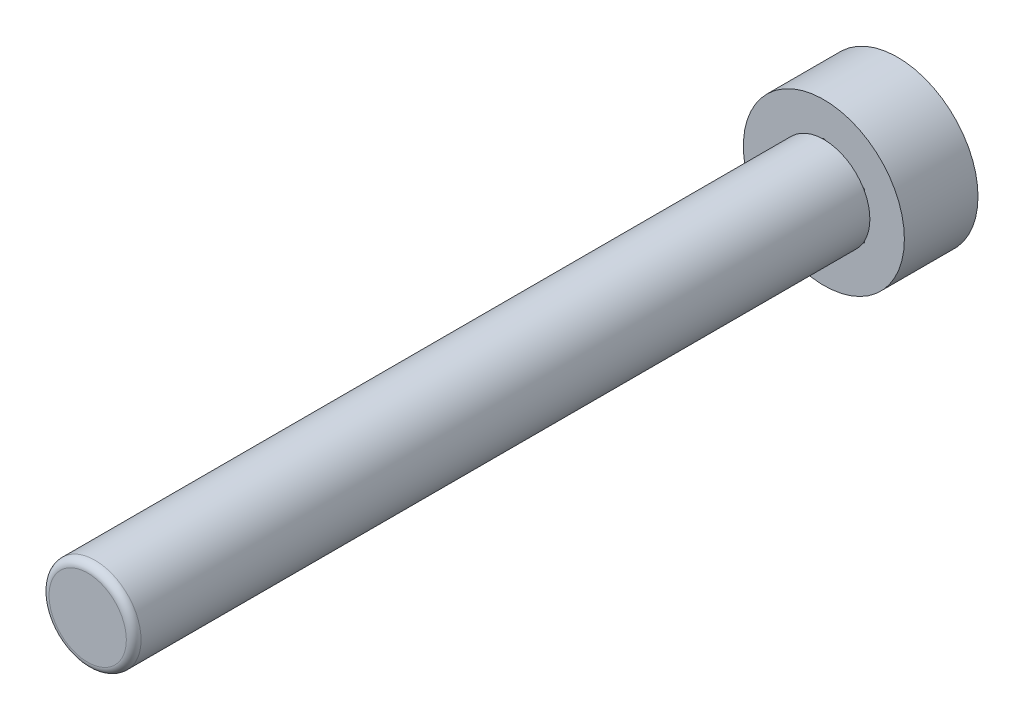
ISO-10303-21;
HEADER;
FILE_DESCRIPTION(('STEP AP214'),'2;1');
FILE_NAME('part.step','',(''),(''),'','','');
FILE_SCHEMA(('AUTOMOTIVE_DESIGN { 1 0 10303 214 1 1 1 1 }'));
ENDSEC;
DATA;
#1=APPLICATION_CONTEXT('core data for automotive mechanical design processes');
#2=APPLICATION_PROTOCOL_DEFINITION('international standard','automotive_design',2000,#1);
#3=PRODUCT_CONTEXT('',#1,'mechanical');
#4=PRODUCT('Part','Part','',(#3));
#5=PRODUCT_RELATED_PRODUCT_CATEGORY('part','',(#4));
#6=PRODUCT_DEFINITION_FORMATION('','',#4);
#7=PRODUCT_DEFINITION_CONTEXT('part definition',#1,'design');
#8=PRODUCT_DEFINITION('design','',#6,#7);
#9=PRODUCT_DEFINITION_SHAPE('','',#8);
#10=(LENGTH_UNIT() NAMED_UNIT(*) SI_UNIT(.MILLI.,.METRE.));
#11=(NAMED_UNIT(*) PLANE_ANGLE_UNIT() SI_UNIT($,.RADIAN.));
#12=(NAMED_UNIT(*) SI_UNIT($,.STERADIAN.) SOLID_ANGLE_UNIT());
#13=UNCERTAINTY_MEASURE_WITH_UNIT(LENGTH_MEASURE(1.E-05),#10,'distance_accuracy_value','');
#14=(GEOMETRIC_REPRESENTATION_CONTEXT(3) GLOBAL_UNCERTAINTY_ASSIGNED_CONTEXT((#13)) GLOBAL_UNIT_ASSIGNED_CONTEXT((#10,
#11,#12)) REPRESENTATION_CONTEXT('',''));
#15=CARTESIAN_POINT('',(0.,0.,0.));
#16=DIRECTION('',(0.,0.,1.));
#17=DIRECTION('',(1.,0.,0.));
#18=AXIS2_PLACEMENT_3D('',#15,#16,#17);
#19=CARTESIAN_POINT('',(0.,0.,5.08));
#20=DIRECTION('',(0.,0.,1.));
#21=DIRECTION('',(1.,0.,0.));
#22=AXIS2_PLACEMENT_3D('',#19,#20,#21);
#23=PLANE('',#22);
#24=CARTESIAN_POINT('',(0.,0.,5.08));
#25=DIRECTION('',(0.,0.,1.));
#26=DIRECTION('',(1.,0.,0.));
#27=AXIS2_PLACEMENT_3D('',#24,#25,#26);
#28=CIRCLE('',#27,3.175);
#29=CARTESIAN_POINT('',(2.7030022013764,1.66565425564681,5.08));
#30=VERTEX_POINT('',#29);
#31=CARTESIAN_POINT('',(0.0909977986236019,3.17369570070063,5.08));
#32=VERTEX_POINT('',#31);
#33=EDGE_CURVE('E171',#30,#32,#28,.T.);
#34=ORIENTED_EDGE('',*,*,#33,.F.);
#35=DIRECTION('',(-0.866025403784439,0.5,0.));
#36=VECTOR('',#35,1.);
#37=CARTESIAN_POINT('',(2.794,1.61311665211582,5.08));
#38=LINE('',#37,#36);
#39=CARTESIAN_POINT('',(2.794,1.61311665211582,5.08));
#40=VERTEX_POINT('',#39);
#41=EDGE_CURVE('E148',#40,#30,#38,.T.);
#42=ORIENTED_EDGE('',*,*,#41,.F.);
#43=DIRECTION('',(0.,1.,0.));
#44=VECTOR('',#43,1.);
#45=CARTESIAN_POINT('',(2.794,-1.61311665211581,5.08));
#46=LINE('',#45,#44);
#47=CARTESIAN_POINT('',(2.794,1.50804144505382,5.08));
#48=VERTEX_POINT('',#47);
#49=EDGE_CURVE('E133',#48,#40,#46,.T.);
#50=ORIENTED_EDGE('',*,*,#49,.F.);
#51=CARTESIAN_POINT('',(2.794,-1.50804144505382,5.08));
#52=VERTEX_POINT('',#51);
#53=EDGE_CURVE('E146',#52,#48,#28,.T.);
#54=ORIENTED_EDGE('',*,*,#53,.F.);
#55=CARTESIAN_POINT('',(2.794,-1.61311665211581,5.08));
#56=VERTEX_POINT('',#55);
#57=EDGE_CURVE('E137',#56,#52,#46,.T.);
#58=ORIENTED_EDGE('',*,*,#57,.F.);
#59=DIRECTION('',(0.866025403784439,0.5,0.));
#60=VECTOR('',#59,1.);
#61=CARTESIAN_POINT('',(0.,-3.22623330423163,5.08));
#62=LINE('',#61,#60);
#63=CARTESIAN_POINT('',(2.7030022013764,-1.66565425564681,5.08));
#64=VERTEX_POINT('',#63);
#65=EDGE_CURVE('E198',#64,#56,#62,.T.);
#66=ORIENTED_EDGE('',*,*,#65,.F.);
#67=CARTESIAN_POINT('',(0.0909977986236017,-3.17369570070063,5.08));
#68=VERTEX_POINT('',#67);
#69=EDGE_CURVE('E157',#68,#64,#28,.T.);
#70=ORIENTED_EDGE('',*,*,#69,.F.);
#71=CARTESIAN_POINT('',(0.,-3.22623330423163,5.08));
#72=VERTEX_POINT('',#71);
#73=EDGE_CURVE('E200',#72,#68,#62,.T.);
#74=ORIENTED_EDGE('',*,*,#73,.F.);
#75=DIRECTION('',(0.866025403784439,-0.5,0.));
#76=VECTOR('',#75,1.);
#77=CARTESIAN_POINT('',(-2.794,-1.61311665211581,5.08));
#78=LINE('',#77,#76);
#79=CARTESIAN_POINT('',(-0.0909977986235995,-3.17369570070063,5.08));
#80=VERTEX_POINT('',#79);
#81=EDGE_CURVE('E190',#80,#72,#78,.T.);
#82=ORIENTED_EDGE('',*,*,#81,.F.);
#83=CARTESIAN_POINT('',(-2.7030022013764,-1.66565425564681,5.08));
#84=VERTEX_POINT('',#83);
#85=EDGE_CURVE('E237',#84,#80,#28,.T.);
#86=ORIENTED_EDGE('',*,*,#85,.F.);
#87=CARTESIAN_POINT('',(-2.794,-1.61311665211581,5.08));
#88=VERTEX_POINT('',#87);
#89=EDGE_CURVE('E195',#88,#84,#78,.T.);
#90=ORIENTED_EDGE('',*,*,#89,.F.);
#91=DIRECTION('',(0.,-1.,0.));
#92=VECTOR('',#91,1.);
#93=CARTESIAN_POINT('',(-2.794,1.61311665211581,5.08));
#94=LINE('',#93,#92);
#95=CARTESIAN_POINT('',(-2.794,-1.50804144505382,5.08));
#96=VERTEX_POINT('',#95);
#97=EDGE_CURVE('E188',#96,#88,#94,.T.);
#98=ORIENTED_EDGE('',*,*,#97,.F.);
#99=CARTESIAN_POINT('',(-2.794,1.50804144505382,5.08));
#100=VERTEX_POINT('',#99);
#101=EDGE_CURVE('E59',#100,#96,#28,.T.);
#102=ORIENTED_EDGE('',*,*,#101,.F.);
#103=CARTESIAN_POINT('',(-2.794,1.61311665211581,5.08));
#104=VERTEX_POINT('',#103);
#105=EDGE_CURVE('E187',#104,#100,#94,.T.);
#106=ORIENTED_EDGE('',*,*,#105,.F.);
#107=DIRECTION('',(-0.866025403784439,-0.5,0.));
#108=VECTOR('',#107,1.);
#109=CARTESIAN_POINT('',(0.,3.22623330423163,5.08));
#110=LINE('',#109,#108);
#111=CARTESIAN_POINT('',(-2.7030022013764,1.66565425564681,5.08));
#112=VERTEX_POINT('',#111);
#113=EDGE_CURVE('E247',#112,#104,#110,.T.);
#114=ORIENTED_EDGE('',*,*,#113,.F.);
#115=CARTESIAN_POINT('',(-0.0909977986236013,3.17369570070063,5.08));
#116=VERTEX_POINT('',#115);
#117=EDGE_CURVE('E52',#116,#112,#28,.T.);
#118=ORIENTED_EDGE('',*,*,#117,.F.);
#119=CARTESIAN_POINT('',(0.,3.22623330423163,5.08));
#120=VERTEX_POINT('',#119);
#121=EDGE_CURVE('E191',#120,#116,#110,.T.);
#122=ORIENTED_EDGE('',*,*,#121,.F.);
#123=EDGE_CURVE('E246',#32,#120,#38,.T.);
#124=ORIENTED_EDGE('',*,*,#123,.F.);
#125=EDGE_LOOP('',(#34,#42,#50,#54,#58,#66,#70,#74,#82,#86,#90,#98,#102,#106,#114,#118,#122,#124));
#126=FACE_BOUND('',#125,.T.);
#127=CARTESIAN_POINT('',(0.,0.,5.08));
#128=DIRECTION('',(0.,0.,1.));
#129=DIRECTION('',(1.,0.,0.));
#130=AXIS2_PLACEMENT_3D('',#127,#128,#129);
#131=CIRCLE('',#130,5.55625);
#132=CARTESIAN_POINT('',(5.55625,0.,5.08));
#133=VERTEX_POINT('',#132);
#134=EDGE_CURVE('E158',#133,#133,#131,.T.);
#135=ORIENTED_EDGE('',*,*,#134,.T.);
#136=EDGE_LOOP('',(#135));
#137=FACE_BOUND('',#136,.T.);
#138=ADVANCED_FACE('F37',(#126,#137),#23,.T.);
#139=CARTESIAN_POINT('',(0.,0.,0.));
#140=DIRECTION('',(0.,0.,1.));
#141=DIRECTION('',(1.,0.,0.));
#142=AXIS2_PLACEMENT_3D('',#139,#140,#141);
#143=PLANE('',#142);
#144=CARTESIAN_POINT('',(0.,0.,0.));
#145=DIRECTION('',(0.,0.,1.));
#146=DIRECTION('',(1.,0.,0.));
#147=AXIS2_PLACEMENT_3D('',#144,#145,#146);
#148=CIRCLE('',#147,5.55625);
#149=CARTESIAN_POINT('',(5.55625,0.,0.));
#150=VERTEX_POINT('',#149);
#151=EDGE_CURVE('E230',#150,#150,#148,.T.);
#152=ORIENTED_EDGE('',*,*,#151,.F.);
#153=EDGE_LOOP('',(#152));
#154=FACE_BOUND('',#153,.T.);
#155=DIRECTION('',(0.,1.,0.));
#156=VECTOR('',#155,1.);
#157=CARTESIAN_POINT('',(2.794,-1.61311665211581,0.));
#158=LINE('',#157,#156);
#159=CARTESIAN_POINT('',(2.794,-1.61311665211582,0.));
#160=VERTEX_POINT('',#159);
#161=CARTESIAN_POINT('',(2.794,1.61311665211582,0.));
#162=VERTEX_POINT('',#161);
#163=EDGE_CURVE('E164',#160,#162,#158,.T.);
#164=ORIENTED_EDGE('',*,*,#163,.T.);
#165=DIRECTION('',(-0.866025403784439,0.5,0.));
#166=VECTOR('',#165,1.);
#167=CARTESIAN_POINT('',(2.794,1.61311665211582,0.));
#168=LINE('',#167,#166);
#169=CARTESIAN_POINT('',(0.,3.22623330423163,0.));
#170=VERTEX_POINT('',#169);
#171=EDGE_CURVE('E167',#162,#170,#168,.T.);
#172=ORIENTED_EDGE('',*,*,#171,.T.);
#173=DIRECTION('',(-0.866025403784439,-0.5,0.));
#174=VECTOR('',#173,1.);
#175=CARTESIAN_POINT('',(0.,3.22623330423163,0.));
#176=LINE('',#175,#174);
#177=CARTESIAN_POINT('',(-2.794,1.61311665211581,0.));
#178=VERTEX_POINT('',#177);
#179=EDGE_CURVE('E207',#170,#178,#176,.T.);
#180=ORIENTED_EDGE('',*,*,#179,.T.);
#181=DIRECTION('',(0.,-1.,0.));
#182=VECTOR('',#181,1.);
#183=CARTESIAN_POINT('',(-2.794,1.61311665211581,0.));
#184=LINE('',#183,#182);
#185=CARTESIAN_POINT('',(-2.794,-1.61311665211581,0.));
#186=VERTEX_POINT('',#185);
#187=EDGE_CURVE('E210',#178,#186,#184,.T.);
#188=ORIENTED_EDGE('',*,*,#187,.T.);
#189=DIRECTION('',(0.866025403784439,-0.5,0.));
#190=VECTOR('',#189,1.);
#191=CARTESIAN_POINT('',(-2.794,-1.61311665211581,0.));
#192=LINE('',#191,#190);
#193=CARTESIAN_POINT('',(0.,-3.22623330423163,0.));
#194=VERTEX_POINT('',#193);
#195=EDGE_CURVE('E213',#186,#194,#192,.T.);
#196=ORIENTED_EDGE('',*,*,#195,.T.);
#197=DIRECTION('',(0.866025403784439,0.5,0.));
#198=VECTOR('',#197,1.);
#199=CARTESIAN_POINT('',(0.,-3.22623330423163,0.));
#200=LINE('',#199,#198);
#201=EDGE_CURVE('E149',#194,#160,#200,.T.);
#202=ORIENTED_EDGE('',*,*,#201,.T.);
#203=EDGE_LOOP('',(#164,#172,#180,#188,#196,#202));
#204=FACE_BOUND('',#203,.T.);
#205=ADVANCED_FACE('F259',(#154,#204),#143,.F.);
#206=CARTESIAN_POINT('',(0.,0.,5.08));
#207=DIRECTION('',(0.,0.,-1.));
#208=DIRECTION('',(-1.,0.,0.));
#209=AXIS2_PLACEMENT_3D('',#206,#207,#208);
#210=CYLINDRICAL_SURFACE('',#209,5.55625);
#211=ORIENTED_EDGE('',*,*,#134,.F.);
#212=EDGE_LOOP('',(#211));
#213=FACE_BOUND('',#212,.T.);
#214=ORIENTED_EDGE('',*,*,#151,.T.);
#215=EDGE_LOOP('',(#214));
#216=FACE_BOUND('',#215,.T.);
#217=ADVANCED_FACE('F280',(#213,#216),#210,.T.);
#218=CARTESIAN_POINT('',(2.794,-1.61311665211581,5.08));
#219=DIRECTION('',(-1.,0.,0.));
#220=DIRECTION('',(0.,-1.,0.));
#221=AXIS2_PLACEMENT_3D('',#218,#219,#220);
#222=PLANE('',#221);
#223=ORIENTED_EDGE('',*,*,#163,.F.);
#224=DIRECTION('',(0.,0.,-1.));
#225=VECTOR('',#224,1.);
#226=CARTESIAN_POINT('',(2.794,-1.61311665211581,5.08));
#227=LINE('',#226,#225);
#228=EDGE_CURVE('E202',#56,#160,#227,.T.);
#229=ORIENTED_EDGE('',*,*,#228,.F.);
#230=ORIENTED_EDGE('',*,*,#57,.T.);
#231=EDGE_CURVE('E129',#52,#48,#46,.T.);
#232=ORIENTED_EDGE('',*,*,#231,.T.);
#233=ORIENTED_EDGE('',*,*,#49,.T.);
#234=DIRECTION('',(0.,0.,-1.));
#235=VECTOR('',#234,1.);
#236=CARTESIAN_POINT('',(2.794,1.61311665211582,5.08));
#237=LINE('',#236,#235);
#238=EDGE_CURVE('E228',#40,#162,#237,.T.);
#239=ORIENTED_EDGE('',*,*,#238,.T.);
#240=EDGE_LOOP('',(#223,#229,#230,#232,#233,#239));
#241=FACE_BOUND('',#240,.T.);
#242=ADVANCED_FACE('F131',(#241),#222,.T.);
#243=CARTESIAN_POINT('',(2.794,1.61311665211582,5.08));
#244=DIRECTION('',(-0.5,-0.866025403784439,0.));
#245=DIRECTION('',(0.866025403784439,-0.5,0.));
#246=AXIS2_PLACEMENT_3D('',#243,#244,#245);
#247=PLANE('',#246);
#248=ORIENTED_EDGE('',*,*,#171,.F.);
#249=ORIENTED_EDGE('',*,*,#238,.F.);
#250=ORIENTED_EDGE('',*,*,#41,.T.);
#251=EDGE_CURVE('E163',#30,#32,#38,.T.);
#252=ORIENTED_EDGE('',*,*,#251,.T.);
#253=ORIENTED_EDGE('',*,*,#123,.T.);
#254=DIRECTION('',(0.,0.,-1.));
#255=VECTOR('',#254,1.);
#256=CARTESIAN_POINT('',(0.,3.22623330423163,5.08));
#257=LINE('',#256,#255);
#258=EDGE_CURVE('E226',#120,#170,#257,.T.);
#259=ORIENTED_EDGE('',*,*,#258,.T.);
#260=EDGE_LOOP('',(#248,#249,#250,#252,#253,#259));
#261=FACE_BOUND('',#260,.T.);
#262=ADVANCED_FACE('F250',(#261),#247,.T.);
#263=CARTESIAN_POINT('',(0.,3.22623330423163,5.08));
#264=DIRECTION('',(0.5,-0.866025403784439,0.));
#265=DIRECTION('',(0.866025403784439,0.5,0.));
#266=AXIS2_PLACEMENT_3D('',#263,#264,#265);
#267=PLANE('',#266);
#268=ORIENTED_EDGE('',*,*,#179,.F.);
#269=ORIENTED_EDGE('',*,*,#258,.F.);
#270=ORIENTED_EDGE('',*,*,#121,.T.);
#271=EDGE_CURVE('E183',#116,#112,#110,.T.);
#272=ORIENTED_EDGE('',*,*,#271,.T.);
#273=ORIENTED_EDGE('',*,*,#113,.T.);
#274=DIRECTION('',(0.,0.,-1.));
#275=VECTOR('',#274,1.);
#276=CARTESIAN_POINT('',(-2.794,1.61311665211581,5.08));
#277=LINE('',#276,#275);
#278=EDGE_CURVE('E224',#104,#178,#277,.T.);
#279=ORIENTED_EDGE('',*,*,#278,.T.);
#280=EDGE_LOOP('',(#268,#269,#270,#272,#273,#279));
#281=FACE_BOUND('',#280,.T.);
#282=ADVANCED_FACE('F254',(#281),#267,.T.);
#283=CARTESIAN_POINT('',(-2.794,1.61311665211581,5.08));
#284=DIRECTION('',(1.,0.,0.));
#285=DIRECTION('',(0.,1.,0.));
#286=AXIS2_PLACEMENT_3D('',#283,#284,#285);
#287=PLANE('',#286);
#288=ORIENTED_EDGE('',*,*,#187,.F.);
#289=ORIENTED_EDGE('',*,*,#278,.F.);
#290=ORIENTED_EDGE('',*,*,#105,.T.);
#291=EDGE_CURVE('E184',#100,#96,#94,.T.);
#292=ORIENTED_EDGE('',*,*,#291,.T.);
#293=ORIENTED_EDGE('',*,*,#97,.T.);
#294=DIRECTION('',(0.,0.,-1.));
#295=VECTOR('',#294,1.);
#296=CARTESIAN_POINT('',(-2.794,-1.61311665211581,5.08));
#297=LINE('',#296,#295);
#298=EDGE_CURVE('E222',#88,#186,#297,.T.);
#299=ORIENTED_EDGE('',*,*,#298,.T.);
#300=EDGE_LOOP('',(#288,#289,#290,#292,#293,#299));
#301=FACE_BOUND('',#300,.T.);
#302=ADVANCED_FACE('F257',(#301),#287,.T.);
#303=CARTESIAN_POINT('',(-2.794,-1.61311665211581,5.08));
#304=DIRECTION('',(0.5,0.866025403784439,0.));
#305=DIRECTION('',(-0.866025403784439,0.5,0.));
#306=AXIS2_PLACEMENT_3D('',#303,#304,#305);
#307=PLANE('',#306);
#308=ORIENTED_EDGE('',*,*,#195,.F.);
#309=ORIENTED_EDGE('',*,*,#298,.F.);
#310=ORIENTED_EDGE('',*,*,#89,.T.);
#311=EDGE_CURVE('E199',#84,#80,#78,.T.);
#312=ORIENTED_EDGE('',*,*,#311,.T.);
#313=ORIENTED_EDGE('',*,*,#81,.T.);
#314=DIRECTION('',(0.,0.,-1.));
#315=VECTOR('',#314,1.);
#316=CARTESIAN_POINT('',(0.,-3.22623330423163,5.08));
#317=LINE('',#316,#315);
#318=EDGE_CURVE('E220',#72,#194,#317,.T.);
#319=ORIENTED_EDGE('',*,*,#318,.T.);
#320=EDGE_LOOP('',(#308,#309,#310,#312,#313,#319));
#321=FACE_BOUND('',#320,.T.);
#322=ADVANCED_FACE('F263',(#321),#307,.T.);
#323=CARTESIAN_POINT('',(0.,-3.22623330423163,5.08));
#324=DIRECTION('',(-0.5,0.866025403784439,0.));
#325=DIRECTION('',(-0.866025403784439,-0.5,0.));
#326=AXIS2_PLACEMENT_3D('',#323,#324,#325);
#327=PLANE('',#326);
#328=ORIENTED_EDGE('',*,*,#201,.F.);
#329=ORIENTED_EDGE('',*,*,#318,.F.);
#330=ORIENTED_EDGE('',*,*,#73,.T.);
#331=EDGE_CURVE('E203',#68,#64,#62,.T.);
#332=ORIENTED_EDGE('',*,*,#331,.T.);
#333=ORIENTED_EDGE('',*,*,#65,.T.);
#334=ORIENTED_EDGE('',*,*,#228,.T.);
#335=EDGE_LOOP('',(#328,#329,#330,#332,#333,#334));
#336=FACE_BOUND('',#335,.T.);
#337=ADVANCED_FACE('F245',(#336),#327,.T.);
#338=CARTESIAN_POINT('',(0.,0.,55.88));
#339=DIRECTION('',(0.,0.,-1.));
#340=DIRECTION('',(-1.,0.,0.));
#341=AXIS2_PLACEMENT_3D('',#338,#339,#340);
#342=CYLINDRICAL_SURFACE('',#341,3.175);
#343=CARTESIAN_POINT('',(0.,0.,55.372));
#344=DIRECTION('',(0.,0.,1.));
#345=DIRECTION('',(1.,0.,0.));
#346=AXIS2_PLACEMENT_3D('',#343,#344,#345);
#347=CIRCLE('',#346,3.175);
#348=CARTESIAN_POINT('',(3.175,0.,55.372));
#349=VERTEX_POINT('',#348);
#350=EDGE_CURVE('E11',#349,#349,#347,.F.);
#351=ORIENTED_EDGE('',*,*,#350,.T.);
#352=EDGE_LOOP('',(#351));
#353=FACE_BOUND('',#352,.T.);
#354=EDGE_CURVE('E154',#48,#30,#28,.T.);
#355=ORIENTED_EDGE('',*,*,#354,.T.);
#356=ORIENTED_EDGE('',*,*,#33,.T.);
#357=EDGE_CURVE('E165',#32,#116,#28,.T.);
#358=ORIENTED_EDGE('',*,*,#357,.T.);
#359=ORIENTED_EDGE('',*,*,#117,.T.);
#360=EDGE_CURVE('E170',#112,#100,#28,.T.);
#361=ORIENTED_EDGE('',*,*,#360,.T.);
#362=ORIENTED_EDGE('',*,*,#101,.T.);
#363=EDGE_CURVE('E174',#96,#84,#28,.T.);
#364=ORIENTED_EDGE('',*,*,#363,.T.);
#365=ORIENTED_EDGE('',*,*,#85,.T.);
#366=EDGE_CURVE('E172',#80,#68,#28,.T.);
#367=ORIENTED_EDGE('',*,*,#366,.T.);
#368=ORIENTED_EDGE('',*,*,#69,.T.);
#369=EDGE_CURVE('E156',#64,#52,#28,.T.);
#370=ORIENTED_EDGE('',*,*,#369,.T.);
#371=ORIENTED_EDGE('',*,*,#53,.T.);
#372=EDGE_LOOP('',(#355,#356,#358,#359,#361,#362,#364,#365,#367,#368,#370,#371));
#373=FACE_BOUND('',#372,.T.);
#374=ADVANCED_FACE('F152',(#353,#373),#342,.T.);
#375=CARTESIAN_POINT('',(0.,0.,55.88));
#376=DIRECTION('',(0.,0.,1.));
#377=DIRECTION('',(1.,0.,0.));
#378=AXIS2_PLACEMENT_3D('',#375,#376,#377);
#379=PLANE('',#378);
#380=CARTESIAN_POINT('',(0.,0.,55.88));
#381=DIRECTION('',(0.,0.,1.));
#382=DIRECTION('',(1.,0.,0.));
#383=AXIS2_PLACEMENT_3D('',#380,#381,#382);
#384=CIRCLE('',#383,2.667);
#385=CARTESIAN_POINT('',(2.667,0.,55.88));
#386=VERTEX_POINT('',#385);
#387=EDGE_CURVE('E45',#386,#386,#384,.T.);
#388=ORIENTED_EDGE('',*,*,#387,.T.);
#389=EDGE_LOOP('',(#388));
#390=FACE_BOUND('',#389,.T.);
#391=ADVANCED_FACE('F318',(#390),#379,.T.);
#392=CARTESIAN_POINT('',(0.,0.,5.08));
#393=DIRECTION('',(0.,0.,1.));
#394=DIRECTION('',(1.,0.,0.));
#395=AXIS2_PLACEMENT_3D('',#392,#393,#394);
#396=PLANE('',#395);
#397=ORIENTED_EDGE('',*,*,#251,.F.);
#398=ORIENTED_EDGE('',*,*,#354,.F.);
#399=ORIENTED_EDGE('',*,*,#231,.F.);
#400=ORIENTED_EDGE('',*,*,#369,.F.);
#401=ORIENTED_EDGE('',*,*,#331,.F.);
#402=ORIENTED_EDGE('',*,*,#366,.F.);
#403=ORIENTED_EDGE('',*,*,#311,.F.);
#404=ORIENTED_EDGE('',*,*,#363,.F.);
#405=ORIENTED_EDGE('',*,*,#291,.F.);
#406=ORIENTED_EDGE('',*,*,#360,.F.);
#407=ORIENTED_EDGE('',*,*,#271,.F.);
#408=ORIENTED_EDGE('',*,*,#357,.F.);
#409=EDGE_LOOP('',(#397,#398,#399,#400,#401,#402,#403,#404,#405,#406,#407,#408));
#410=FACE_BOUND('',#409,.T.);
#411=ADVANCED_FACE('F161',(#410),#396,.F.);
#412=CARTESIAN_POINT('',(0.,0.,55.372));
#413=DIRECTION('',(0.,0.,1.));
#414=DIRECTION('',(1.,0.,0.));
#415=AXIS2_PLACEMENT_3D('',#412,#413,#414);
#416=TOROIDAL_SURFACE('',#415,2.667,0.508);
#417=ORIENTED_EDGE('',*,*,#350,.F.);
#418=EDGE_LOOP('',(#417));
#419=FACE_BOUND('',#418,.T.);
#420=ORIENTED_EDGE('',*,*,#387,.F.);
#421=EDGE_LOOP('',(#420));
#422=FACE_BOUND('',#421,.T.);
#423=ADVANCED_FACE('F39',(#419,#422),#416,.T.);
#424=CLOSED_SHELL('',(#138,#205,#217,#242,#262,#282,#302,#322,#337,#374,#391,#411,#423));
#425=MANIFOLD_SOLID_BREP('B2',#424);
#426=ADVANCED_BREP_SHAPE_REPRESENTATION('',(#18,#425),#14);
#427=SHAPE_DEFINITION_REPRESENTATION(#9,#426);
ENDSEC;
END-ISO-10303-21;
